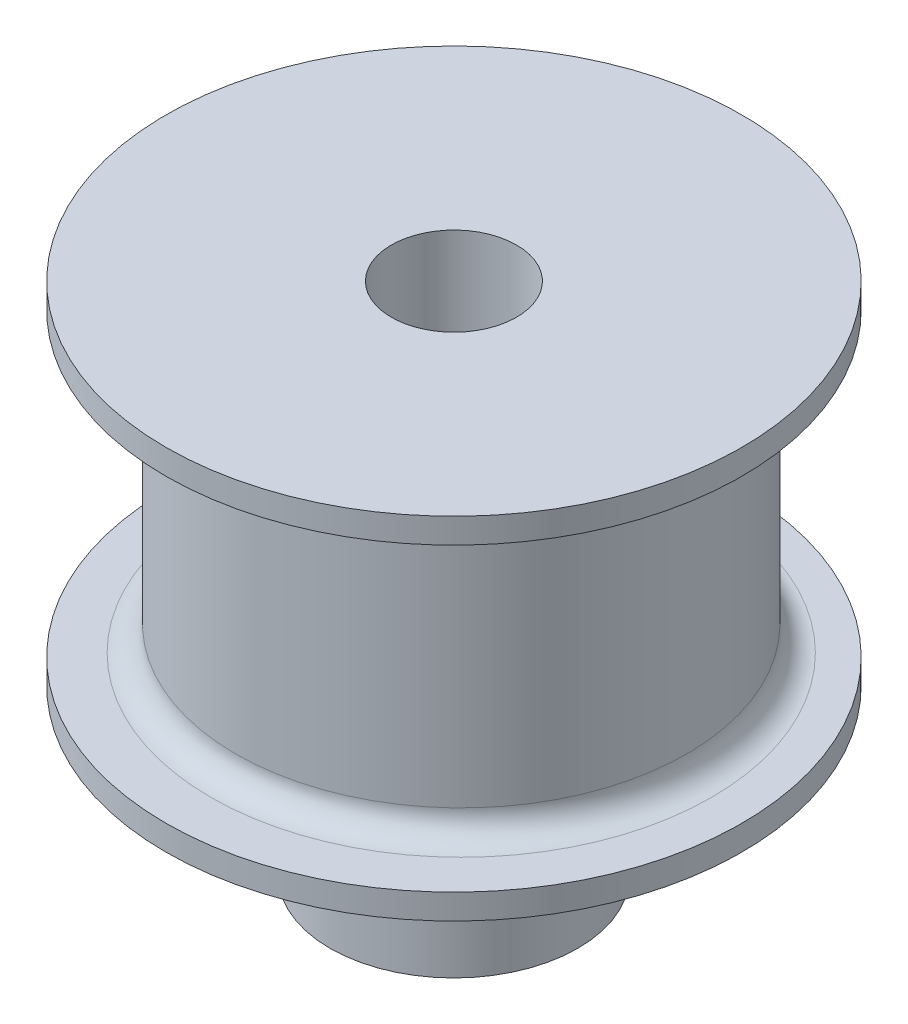
ISO-10303-21;
HEADER;
FILE_DESCRIPTION(('STEP AP214'),'2;1');
FILE_NAME('part.step','',(''),(''),'','','');
FILE_SCHEMA(('AUTOMOTIVE_DESIGN { 1 0 10303 214 1 1 1 1 }'));
ENDSEC;
DATA;
#1=APPLICATION_CONTEXT('core data for automotive mechanical design processes');
#2=APPLICATION_PROTOCOL_DEFINITION('international standard','automotive_design',2000,#1);
#3=PRODUCT_CONTEXT('',#1,'mechanical');
#4=PRODUCT('Part','Part','',(#3));
#5=PRODUCT_RELATED_PRODUCT_CATEGORY('part','',(#4));
#6=PRODUCT_DEFINITION_FORMATION('','',#4);
#7=PRODUCT_DEFINITION_CONTEXT('part definition',#1,'design');
#8=PRODUCT_DEFINITION('design','',#6,#7);
#9=PRODUCT_DEFINITION_SHAPE('','',#8);
#10=(LENGTH_UNIT() NAMED_UNIT(*) SI_UNIT(.MILLI.,.METRE.));
#11=(NAMED_UNIT(*) PLANE_ANGLE_UNIT() SI_UNIT($,.RADIAN.));
#12=(NAMED_UNIT(*) SI_UNIT($,.STERADIAN.) SOLID_ANGLE_UNIT());
#13=UNCERTAINTY_MEASURE_WITH_UNIT(LENGTH_MEASURE(1.E-05),#10,'distance_accuracy_value','');
#14=(GEOMETRIC_REPRESENTATION_CONTEXT(3) GLOBAL_UNCERTAINTY_ASSIGNED_CONTEXT((#13)) GLOBAL_UNIT_ASSIGNED_CONTEXT((#10,
#11,#12)) REPRESENTATION_CONTEXT('',''));
#15=CARTESIAN_POINT('',(0.,0.,0.));
#16=DIRECTION('',(0.,0.,1.));
#17=DIRECTION('',(1.,0.,0.));
#18=AXIS2_PLACEMENT_3D('',#15,#16,#17);
#19=CARTESIAN_POINT('',(0.,7.6,0.));
#20=DIRECTION('',(0.,1.,0.));
#21=DIRECTION('',(0.,0.,1.));
#22=AXIS2_PLACEMENT_3D('',#19,#20,#21);
#23=PLANE('',#22);
#24=CARTESIAN_POINT('',(0.,7.6,-0.291114711728824));
#25=DIRECTION('',(0.,1.,0.));
#26=DIRECTION('',(0.,0.,1.));
#27=AXIS2_PLACEMENT_3D('',#24,#25,#26);
#28=CIRCLE('',#27,10.);
#29=CARTESIAN_POINT('',(0.,7.6,9.70888528827117));
#30=VERTEX_POINT('',#29);
#31=EDGE_CURVE('E41',#30,#30,#28,.F.);
#32=ORIENTED_EDGE('',*,*,#31,.T.);
#33=EDGE_LOOP('',(#32));
#34=FACE_BOUND('',#33,.T.);
#35=CARTESIAN_POINT('',(0.,7.6,0.));
#36=DIRECTION('',(0.,1.,0.));
#37=DIRECTION('',(0.,0.,1.));
#38=AXIS2_PLACEMENT_3D('',#35,#36,#37);
#39=CIRCLE('',#38,11.5);
#40=CARTESIAN_POINT('',(0.,7.6,11.5));
#41=VERTEX_POINT('',#40);
#42=EDGE_CURVE('E54',#41,#41,#39,.T.);
#43=ORIENTED_EDGE('',*,*,#42,.T.);
#44=EDGE_LOOP('',(#43));
#45=FACE_BOUND('',#44,.T.);
#46=ADVANCED_FACE('F30',(#34,#45),#23,.T.);
#47=CARTESIAN_POINT('',(0.,6.6,0.));
#48=DIRECTION('',(0.,-1.,0.));
#49=DIRECTION('',(0.,0.,-1.));
#50=AXIS2_PLACEMENT_3D('',#47,#48,#49);
#51=CYLINDRICAL_SURFACE('',#50,4.95);
#52=CARTESIAN_POINT('',(0.,6.6,0.));
#53=DIRECTION('',(0.,1.,0.));
#54=DIRECTION('',(0.,0.,1.));
#55=AXIS2_PLACEMENT_3D('',#52,#53,#54);
#56=CIRCLE('',#55,4.95);
#57=CARTESIAN_POINT('',(0.,6.6,4.95));
#58=VERTEX_POINT('',#57);
#59=EDGE_CURVE('E50',#58,#58,#56,.T.);
#60=ORIENTED_EDGE('',*,*,#59,.F.);
#61=EDGE_LOOP('',(#60));
#62=FACE_BOUND('',#61,.T.);
#63=CARTESIAN_POINT('',(0.,0.,0.));
#64=DIRECTION('',(0.,1.,0.));
#65=DIRECTION('',(0.,0.,1.));
#66=AXIS2_PLACEMENT_3D('',#63,#64,#65);
#67=CIRCLE('',#66,4.95);
#68=CARTESIAN_POINT('',(0.,0.,4.95));
#69=VERTEX_POINT('',#68);
#70=EDGE_CURVE('E51',#69,#69,#67,.T.);
#71=ORIENTED_EDGE('',*,*,#70,.T.);
#72=EDGE_LOOP('',(#71));
#73=FACE_BOUND('',#72,.T.);
#74=ADVANCED_FACE('F88',(#62,#73),#51,.T.);
#75=CARTESIAN_POINT('',(0.,0.,0.));
#76=DIRECTION('',(0.,1.,0.));
#77=DIRECTION('',(0.,0.,1.));
#78=AXIS2_PLACEMENT_3D('',#75,#76,#77);
#79=PLANE('',#78);
#80=CARTESIAN_POINT('',(0.,0.,0.));
#81=DIRECTION('',(0.,-1.,0.));
#82=DIRECTION('',(0.,0.,-1.));
#83=AXIS2_PLACEMENT_3D('',#80,#81,#82);
#84=CIRCLE('',#83,2.5);
#85=CARTESIAN_POINT('',(0.,0.,-2.5));
#86=VERTEX_POINT('',#85);
#87=EDGE_CURVE('E69',#86,#86,#84,.T.);
#88=ORIENTED_EDGE('',*,*,#87,.F.);
#89=EDGE_LOOP('',(#88));
#90=FACE_BOUND('',#89,.T.);
#91=ORIENTED_EDGE('',*,*,#70,.F.);
#92=EDGE_LOOP('',(#91));
#93=FACE_BOUND('',#92,.T.);
#94=ADVANCED_FACE('F84',(#90,#93),#79,.F.);
#95=CARTESIAN_POINT('',(0.,6.6,0.));
#96=DIRECTION('',(0.,1.,0.));
#97=DIRECTION('',(0.,0.,1.));
#98=AXIS2_PLACEMENT_3D('',#95,#96,#97);
#99=PLANE('',#98);
#100=CARTESIAN_POINT('',(0.,6.6,0.));
#101=DIRECTION('',(0.,1.,0.));
#102=DIRECTION('',(0.,0.,1.));
#103=AXIS2_PLACEMENT_3D('',#100,#101,#102);
#104=CIRCLE('',#103,11.5);
#105=CARTESIAN_POINT('',(0.,6.6,11.5));
#106=VERTEX_POINT('',#105);
#107=EDGE_CURVE('E57',#106,#106,#104,.T.);
#108=ORIENTED_EDGE('',*,*,#107,.F.);
#109=EDGE_LOOP('',(#108));
#110=FACE_BOUND('',#109,.T.);
#111=ORIENTED_EDGE('',*,*,#59,.T.);
#112=EDGE_LOOP('',(#111));
#113=FACE_BOUND('',#112,.T.);
#114=ADVANCED_FACE('F87',(#110,#113),#99,.F.);
#115=CARTESIAN_POINT('',(0.,7.6,0.));
#116=DIRECTION('',(0.,-1.,0.));
#117=DIRECTION('',(0.,0.,-1.));
#118=AXIS2_PLACEMENT_3D('',#115,#116,#117);
#119=CYLINDRICAL_SURFACE('',#118,11.5);
#120=ORIENTED_EDGE('',*,*,#42,.F.);
#121=EDGE_LOOP('',(#120));
#122=FACE_BOUND('',#121,.T.);
#123=ORIENTED_EDGE('',*,*,#107,.T.);
#124=EDGE_LOOP('',(#123));
#125=FACE_BOUND('',#124,.T.);
#126=ADVANCED_FACE('F119',(#122,#125),#119,.T.);
#127=CARTESIAN_POINT('',(0.,19.6,-0.291114711728824));
#128=DIRECTION('',(0.,-1.,0.));
#129=DIRECTION('',(0.,0.,-1.));
#130=AXIS2_PLACEMENT_3D('',#127,#128,#129);
#131=CYLINDRICAL_SURFACE('',#130,9.);
#132=CARTESIAN_POINT('',(0.,18.6,-0.291114711728824));
#133=DIRECTION('',(0.,1.,0.));
#134=DIRECTION('',(0.,0.,1.));
#135=AXIS2_PLACEMENT_3D('',#132,#133,#134);
#136=CIRCLE('',#135,9.);
#137=CARTESIAN_POINT('',(0.,18.6,8.70888528827118));
#138=VERTEX_POINT('',#137);
#139=EDGE_CURVE('E10',#138,#138,#136,.F.);
#140=ORIENTED_EDGE('',*,*,#139,.T.);
#141=EDGE_LOOP('',(#140));
#142=FACE_BOUND('',#141,.T.);
#143=CARTESIAN_POINT('',(0.,8.6,-0.291114711728824));
#144=DIRECTION('',(0.,1.,0.));
#145=DIRECTION('',(0.,0.,1.));
#146=AXIS2_PLACEMENT_3D('',#143,#144,#145);
#147=CIRCLE('',#146,9.);
#148=CARTESIAN_POINT('',(0.,8.6,8.70888528827118));
#149=VERTEX_POINT('',#148);
#150=EDGE_CURVE('E45',#149,#149,#147,.T.);
#151=ORIENTED_EDGE('',*,*,#150,.T.);
#152=EDGE_LOOP('',(#151));
#153=FACE_BOUND('',#152,.T.);
#154=ADVANCED_FACE('F116',(#142,#153),#131,.T.);
#155=CARTESIAN_POINT('',(0.,19.6,0.));
#156=DIRECTION('',(0.,1.,0.));
#157=DIRECTION('',(0.,0.,1.));
#158=AXIS2_PLACEMENT_3D('',#155,#156,#157);
#159=PLANE('',#158);
#160=CARTESIAN_POINT('',(0.,19.6,-0.291114711728824));
#161=DIRECTION('',(0.,1.,0.));
#162=DIRECTION('',(0.,0.,1.));
#163=AXIS2_PLACEMENT_3D('',#160,#161,#162);
#164=CIRCLE('',#163,10.);
#165=CARTESIAN_POINT('',(0.,19.6,9.70888528827117));
#166=VERTEX_POINT('',#165);
#167=EDGE_CURVE('E37',#166,#166,#164,.T.);
#168=ORIENTED_EDGE('',*,*,#167,.T.);
#169=EDGE_LOOP('',(#168));
#170=FACE_BOUND('',#169,.T.);
#171=CARTESIAN_POINT('',(0.,19.6,0.));
#172=DIRECTION('',(0.,1.,0.));
#173=DIRECTION('',(0.,0.,1.));
#174=AXIS2_PLACEMENT_3D('',#171,#172,#173);
#175=CIRCLE('',#174,11.5);
#176=CARTESIAN_POINT('',(0.,19.6,11.5));
#177=VERTEX_POINT('',#176);
#178=EDGE_CURVE('E63',#177,#177,#175,.T.);
#179=ORIENTED_EDGE('',*,*,#178,.F.);
#180=EDGE_LOOP('',(#179));
#181=FACE_BOUND('',#180,.T.);
#182=ADVANCED_FACE('F118',(#170,#181),#159,.F.);
#183=CARTESIAN_POINT('',(0.,20.6,0.));
#184=DIRECTION('',(0.,-1.,0.));
#185=DIRECTION('',(0.,0.,-1.));
#186=AXIS2_PLACEMENT_3D('',#183,#184,#185);
#187=CYLINDRICAL_SURFACE('',#186,11.5);
#188=CARTESIAN_POINT('',(0.,20.6,0.));
#189=DIRECTION('',(0.,1.,0.));
#190=DIRECTION('',(0.,0.,1.));
#191=AXIS2_PLACEMENT_3D('',#188,#189,#190);
#192=CIRCLE('',#191,11.5);
#193=CARTESIAN_POINT('',(0.,20.6,11.5));
#194=VERTEX_POINT('',#193);
#195=EDGE_CURVE('E60',#194,#194,#192,.T.);
#196=ORIENTED_EDGE('',*,*,#195,.F.);
#197=EDGE_LOOP('',(#196));
#198=FACE_BOUND('',#197,.T.);
#199=ORIENTED_EDGE('',*,*,#178,.T.);
#200=EDGE_LOOP('',(#199));
#201=FACE_BOUND('',#200,.T.);
#202=ADVANCED_FACE('F110',(#198,#201),#187,.T.);
#203=CARTESIAN_POINT('',(0.,20.6,0.));
#204=DIRECTION('',(0.,1.,0.));
#205=DIRECTION('',(0.,0.,1.));
#206=AXIS2_PLACEMENT_3D('',#203,#204,#205);
#207=PLANE('',#206);
#208=CARTESIAN_POINT('',(0.,20.6,0.));
#209=DIRECTION('',(0.,-1.,0.));
#210=DIRECTION('',(0.,0.,-1.));
#211=AXIS2_PLACEMENT_3D('',#208,#209,#210);
#212=CIRCLE('',#211,2.5);
#213=CARTESIAN_POINT('',(0.,20.6,-2.5));
#214=VERTEX_POINT('',#213);
#215=EDGE_CURVE('E66',#214,#214,#212,.T.);
#216=ORIENTED_EDGE('',*,*,#215,.T.);
#217=EDGE_LOOP('',(#216));
#218=FACE_BOUND('',#217,.T.);
#219=ORIENTED_EDGE('',*,*,#195,.T.);
#220=EDGE_LOOP('',(#219));
#221=FACE_BOUND('',#220,.T.);
#222=ADVANCED_FACE('F75',(#218,#221),#207,.T.);
#223=CARTESIAN_POINT('',(0.,8.6,-0.291114711728824));
#224=DIRECTION('',(0.,1.,0.));
#225=DIRECTION('',(0.,0.,1.));
#226=AXIS2_PLACEMENT_3D('',#223,#224,#225);
#227=TOROIDAL_SURFACE('',#226,10.,1.);
#228=ORIENTED_EDGE('',*,*,#31,.F.);
#229=EDGE_LOOP('',(#228));
#230=FACE_BOUND('',#229,.T.);
#231=ORIENTED_EDGE('',*,*,#150,.F.);
#232=EDGE_LOOP('',(#231));
#233=FACE_BOUND('',#232,.T.);
#234=ADVANCED_FACE('F102',(#230,#233),#227,.F.);
#235=CARTESIAN_POINT('',(0.,18.6,-0.291114711728824));
#236=DIRECTION('',(0.,1.,0.));
#237=DIRECTION('',(0.,0.,1.));
#238=AXIS2_PLACEMENT_3D('',#235,#236,#237);
#239=TOROIDAL_SURFACE('',#238,10.,1.);
#240=ORIENTED_EDGE('',*,*,#139,.F.);
#241=EDGE_LOOP('',(#240));
#242=FACE_BOUND('',#241,.T.);
#243=ORIENTED_EDGE('',*,*,#167,.F.);
#244=EDGE_LOOP('',(#243));
#245=FACE_BOUND('',#244,.T.);
#246=ADVANCED_FACE('F32',(#242,#245),#239,.F.);
#247=CARTESIAN_POINT('',(0.,20.6,0.));
#248=DIRECTION('',(0.,-1.,0.));
#249=DIRECTION('',(0.,0.,-1.));
#250=AXIS2_PLACEMENT_3D('',#247,#248,#249);
#251=CYLINDRICAL_SURFACE('',#250,2.5);
#252=ORIENTED_EDGE('',*,*,#215,.F.);
#253=EDGE_LOOP('',(#252));
#254=FACE_BOUND('',#253,.T.);
#255=ORIENTED_EDGE('',*,*,#87,.T.);
#256=EDGE_LOOP('',(#255));
#257=FACE_BOUND('',#256,.T.);
#258=ADVANCED_FACE('F78',(#254,#257),#251,.F.);
#259=CLOSED_SHELL('',(#46,#74,#94,#114,#126,#154,#182,#202,#222,#234,#246,#258));
#260=MANIFOLD_SOLID_BREP('B2',#259);
#261=ADVANCED_BREP_SHAPE_REPRESENTATION('',(#18,#260),#14);
#262=SHAPE_DEFINITION_REPRESENTATION(#9,#261);
ENDSEC;
END-ISO-10303-21;
